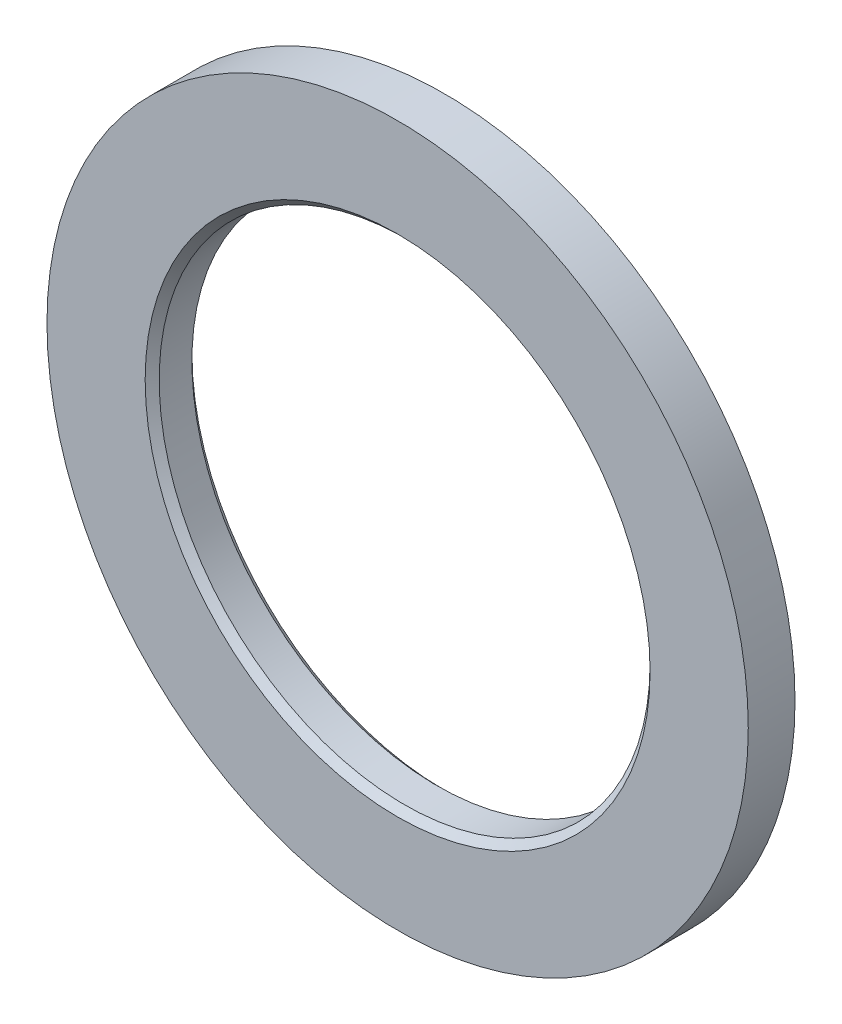
ISO-10303-21;
HEADER;
FILE_DESCRIPTION(('STEP AP214'),'2;1');
FILE_NAME('part.step','',(''),(''),'','','');
FILE_SCHEMA(('AUTOMOTIVE_DESIGN { 1 0 10303 214 1 1 1 1 }'));
ENDSEC;
DATA;
#1=APPLICATION_CONTEXT('core data for automotive mechanical design processes');
#2=APPLICATION_PROTOCOL_DEFINITION('international standard','automotive_design',2000,#1);
#3=PRODUCT_CONTEXT('',#1,'mechanical');
#4=PRODUCT('Part','Part','',(#3));
#5=PRODUCT_RELATED_PRODUCT_CATEGORY('part','',(#4));
#6=PRODUCT_DEFINITION_FORMATION('','',#4);
#7=PRODUCT_DEFINITION_CONTEXT('part definition',#1,'design');
#8=PRODUCT_DEFINITION('design','',#6,#7);
#9=PRODUCT_DEFINITION_SHAPE('','',#8);
#10=(LENGTH_UNIT() NAMED_UNIT(*) SI_UNIT(.MILLI.,.METRE.));
#11=(NAMED_UNIT(*) PLANE_ANGLE_UNIT() SI_UNIT($,.RADIAN.));
#12=(NAMED_UNIT(*) SI_UNIT($,.STERADIAN.) SOLID_ANGLE_UNIT());
#13=UNCERTAINTY_MEASURE_WITH_UNIT(LENGTH_MEASURE(1.E-05),#10,'distance_accuracy_value','');
#14=(GEOMETRIC_REPRESENTATION_CONTEXT(3) GLOBAL_UNCERTAINTY_ASSIGNED_CONTEXT((#13)) GLOBAL_UNIT_ASSIGNED_CONTEXT((#10,
#11,#12)) REPRESENTATION_CONTEXT('',''));
#15=CARTESIAN_POINT('',(0.,0.,0.));
#16=DIRECTION('',(0.,0.,1.));
#17=DIRECTION('',(1.,0.,0.));
#18=AXIS2_PLACEMENT_3D('',#15,#16,#17);
#19=CARTESIAN_POINT('',(0.,0.,5.));
#20=DIRECTION('',(0.,0.,-1.));
#21=DIRECTION('',(-1.,0.,0.));
#22=AXIS2_PLACEMENT_3D('',#19,#20,#21);
#23=CYLINDRICAL_SURFACE('',#22,37.5);
#24=CARTESIAN_POINT('',(0.,0.,5.));
#25=DIRECTION('',(0.,0.,1.));
#26=DIRECTION('',(1.,0.,0.));
#27=AXIS2_PLACEMENT_3D('',#24,#25,#26);
#28=CIRCLE('',#27,37.5);
#29=CARTESIAN_POINT('',(37.5,0.,5.));
#30=VERTEX_POINT('',#29);
#31=EDGE_CURVE('E10',#30,#30,#28,.T.);
#32=ORIENTED_EDGE('',*,*,#31,.F.);
#33=EDGE_LOOP('',(#32));
#34=FACE_BOUND('',#33,.T.);
#35=CARTESIAN_POINT('',(0.,0.,0.));
#36=DIRECTION('',(0.,0.,1.));
#37=DIRECTION('',(1.,0.,0.));
#38=AXIS2_PLACEMENT_3D('',#35,#36,#37);
#39=CIRCLE('',#38,37.5);
#40=CARTESIAN_POINT('',(37.5,0.,0.));
#41=VERTEX_POINT('',#40);
#42=EDGE_CURVE('E35',#41,#41,#39,.T.);
#43=ORIENTED_EDGE('',*,*,#42,.T.);
#44=EDGE_LOOP('',(#43));
#45=FACE_BOUND('',#44,.T.);
#46=ADVANCED_FACE('F32',(#34,#45),#23,.T.);
#47=CARTESIAN_POINT('',(0.,0.,5.));
#48=DIRECTION('',(0.,0.,1.));
#49=DIRECTION('',(1.,0.,0.));
#50=AXIS2_PLACEMENT_3D('',#47,#48,#49);
#51=PLANE('',#50);
#52=CARTESIAN_POINT('',(0.,0.,5.));
#53=DIRECTION('',(0.,0.,1.));
#54=DIRECTION('',(1.,0.,0.));
#55=AXIS2_PLACEMENT_3D('',#52,#53,#54);
#56=CIRCLE('',#55,27.);
#57=CARTESIAN_POINT('',(27.,0.,5.));
#58=VERTEX_POINT('',#57);
#59=EDGE_CURVE('E42',#58,#58,#56,.T.);
#60=ORIENTED_EDGE('',*,*,#59,.F.);
#61=EDGE_LOOP('',(#60));
#62=FACE_BOUND('',#61,.T.);
#63=ORIENTED_EDGE('',*,*,#31,.T.);
#64=EDGE_LOOP('',(#63));
#65=FACE_BOUND('',#64,.T.);
#66=ADVANCED_FACE('F77',(#62,#65),#51,.T.);
#67=CARTESIAN_POINT('',(0.,0.,0.));
#68=DIRECTION('',(0.,0.,1.));
#69=DIRECTION('',(1.,0.,0.));
#70=AXIS2_PLACEMENT_3D('',#67,#68,#69);
#71=PLANE('',#70);
#72=CARTESIAN_POINT('',(0.,0.,0.));
#73=DIRECTION('',(0.,0.,1.));
#74=DIRECTION('',(1.,0.,0.));
#75=AXIS2_PLACEMENT_3D('',#72,#73,#74);
#76=CIRCLE('',#75,27.);
#77=CARTESIAN_POINT('',(27.,0.,0.));
#78=VERTEX_POINT('',#77);
#79=EDGE_CURVE('E52',#78,#78,#76,.T.);
#80=ORIENTED_EDGE('',*,*,#79,.T.);
#81=EDGE_LOOP('',(#80));
#82=FACE_BOUND('',#81,.T.);
#83=ORIENTED_EDGE('',*,*,#42,.F.);
#84=EDGE_LOOP('',(#83));
#85=FACE_BOUND('',#84,.T.);
#86=ADVANCED_FACE('F56',(#82,#85),#71,.F.);
#87=CARTESIAN_POINT('',(0.,0.,0.));
#88=DIRECTION('',(0.,0.,1.));
#89=DIRECTION('',(1.,0.,0.));
#90=AXIS2_PLACEMENT_3D('',#87,#88,#89);
#91=CYLINDRICAL_SURFACE('',#90,26.25);
#92=CARTESIAN_POINT('',(0.,0.,0.750000000000001));
#93=DIRECTION('',(0.,0.,1.));
#94=DIRECTION('',(1.,0.,0.));
#95=AXIS2_PLACEMENT_3D('',#92,#93,#94);
#96=CIRCLE('',#95,26.25);
#97=CARTESIAN_POINT('',(26.25,0.,0.750000000000001));
#98=VERTEX_POINT('',#97);
#99=EDGE_CURVE('E49',#98,#98,#96,.T.);
#100=ORIENTED_EDGE('',*,*,#99,.F.);
#101=EDGE_LOOP('',(#100));
#102=FACE_BOUND('',#101,.T.);
#103=CARTESIAN_POINT('',(0.,0.,4.25));
#104=DIRECTION('',(0.,0.,1.));
#105=DIRECTION('',(1.,0.,0.));
#106=AXIS2_PLACEMENT_3D('',#103,#104,#105);
#107=CIRCLE('',#106,26.25);
#108=CARTESIAN_POINT('',(26.25,0.,4.25));
#109=VERTEX_POINT('',#108);
#110=EDGE_CURVE('E46',#109,#109,#107,.T.);
#111=ORIENTED_EDGE('',*,*,#110,.T.);
#112=EDGE_LOOP('',(#111));
#113=FACE_BOUND('',#112,.T.);
#114=ADVANCED_FACE('F66',(#102,#113),#91,.F.);
#115=CARTESIAN_POINT('',(0.,0.,5.));
#116=DIRECTION('',(0.,0.,1.));
#117=DIRECTION('',(1.,0.,0.));
#118=AXIS2_PLACEMENT_3D('',#115,#116,#117);
#119=CONICAL_SURFACE('',#118,27.,0.785398163397449);
#120=ORIENTED_EDGE('',*,*,#110,.F.);
#121=EDGE_LOOP('',(#120));
#122=FACE_BOUND('',#121,.T.);
#123=ORIENTED_EDGE('',*,*,#59,.T.);
#124=EDGE_LOOP('',(#123));
#125=FACE_BOUND('',#124,.T.);
#126=ADVANCED_FACE('F62',(#122,#125),#119,.F.);
#127=CARTESIAN_POINT('',(0.,0.,0.750000000000001));
#128=DIRECTION('',(0.,0.,-1.));
#129=DIRECTION('',(-1.,0.,0.));
#130=AXIS2_PLACEMENT_3D('',#127,#128,#129);
#131=CONICAL_SURFACE('',#130,26.25,0.785398163397453);
#132=ORIENTED_EDGE('',*,*,#79,.F.);
#133=EDGE_LOOP('',(#132));
#134=FACE_BOUND('',#133,.T.);
#135=ORIENTED_EDGE('',*,*,#99,.T.);
#136=EDGE_LOOP('',(#135));
#137=FACE_BOUND('',#136,.T.);
#138=ADVANCED_FACE('F59',(#134,#137),#131,.F.);
#139=CLOSED_SHELL('',(#46,#66,#86,#114,#126,#138));
#140=MANIFOLD_SOLID_BREP('B2',#139);
#141=ADVANCED_BREP_SHAPE_REPRESENTATION('',(#18,#140),#14);
#142=SHAPE_DEFINITION_REPRESENTATION(#9,#141);
ENDSEC;
END-ISO-10303-21;
